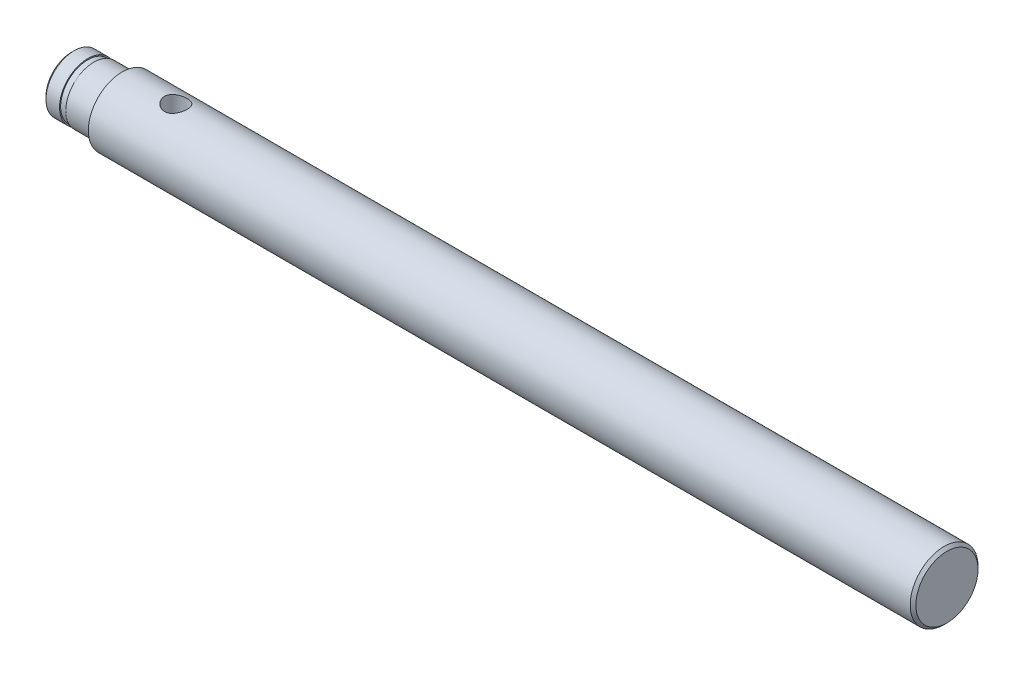
ISO-10303-21;
HEADER;
FILE_DESCRIPTION(('STEP AP214'),'2;1');
FILE_NAME('part.step','',(''),(''),'','','');
FILE_SCHEMA(('AUTOMOTIVE_DESIGN { 1 0 10303 214 1 1 1 1 }'));
ENDSEC;
DATA;
#1=APPLICATION_CONTEXT('core data for automotive mechanical design processes');
#2=APPLICATION_PROTOCOL_DEFINITION('international standard','automotive_design',2000,#1);
#3=PRODUCT_CONTEXT('',#1,'mechanical');
#4=PRODUCT('Part','Part','',(#3));
#5=PRODUCT_RELATED_PRODUCT_CATEGORY('part','',(#4));
#6=PRODUCT_DEFINITION_FORMATION('','',#4);
#7=PRODUCT_DEFINITION_CONTEXT('part definition',#1,'design');
#8=PRODUCT_DEFINITION('design','',#6,#7);
#9=PRODUCT_DEFINITION_SHAPE('','',#8);
#10=(LENGTH_UNIT() NAMED_UNIT(*) SI_UNIT(.MILLI.,.METRE.));
#11=(NAMED_UNIT(*) PLANE_ANGLE_UNIT() SI_UNIT($,.RADIAN.));
#12=(NAMED_UNIT(*) SI_UNIT($,.STERADIAN.) SOLID_ANGLE_UNIT());
#13=UNCERTAINTY_MEASURE_WITH_UNIT(LENGTH_MEASURE(1.E-05),#10,'distance_accuracy_value','');
#14=(GEOMETRIC_REPRESENTATION_CONTEXT(3) GLOBAL_UNCERTAINTY_ASSIGNED_CONTEXT((#13)) GLOBAL_UNIT_ASSIGNED_CONTEXT((#10,
#11,#12)) REPRESENTATION_CONTEXT('',''));
#15=CARTESIAN_POINT('',(0.,0.,0.));
#16=DIRECTION('',(0.,0.,1.));
#17=DIRECTION('',(1.,0.,0.));
#18=AXIS2_PLACEMENT_3D('',#15,#16,#17);
#19=CARTESIAN_POINT('',(155.,0.,0.));
#20=DIRECTION('',(-1.,0.,0.));
#21=DIRECTION('',(0.,0.,1.));
#22=AXIS2_PLACEMENT_3D('',#19,#20,#21);
#23=CYLINDRICAL_SURFACE('',#22,6.);
#24=CARTESIAN_POINT('',(154.5,0.,0.));
#25=DIRECTION('',(1.,0.,0.));
#26=DIRECTION('',(0.,0.,-1.));
#27=AXIS2_PLACEMENT_3D('',#24,#25,#26);
#28=CIRCLE('',#27,6.);
#29=CARTESIAN_POINT('',(154.5,0.,-6.));
#30=VERTEX_POINT('',#29);
#31=EDGE_CURVE('E50',#30,#30,#28,.F.);
#32=ORIENTED_EDGE('',*,*,#31,.T.);
#33=EDGE_LOOP('',(#32));
#34=FACE_BOUND('',#33,.T.);
#35=CARTESIAN_POINT('',(18.5,-5.65685424949238,2.));
#36=CARTESIAN_POINT('',(18.6089363496721,-5.65685389060868,2.00000051589543));
#37=CARTESIAN_POINT('',(18.7178695996472,-5.66003538581715,1.99106956737104));
#38=CARTESIAN_POINT('',(18.9325088419885,-5.6723514816251,1.95570226337762));
#39=CARTESIAN_POINT('',(19.0382142997449,-5.68148706284378,1.92926302433679));
#40=CARTESIAN_POINT('',(19.2432537859946,-5.70456407377583,1.85991097136981));
#41=CARTESIAN_POINT('',(19.3425998588854,-5.71849607942644,1.81703044280649));
#42=CARTESIAN_POINT('',(19.5327200970959,-5.74958244020649,1.71612325688276));
#43=CARTESIAN_POINT('',(19.6234923651073,-5.76673750607225,1.65809325772037));
#44=CARTESIAN_POINT('',(19.7974399246766,-5.80308978814946,1.52610229288576));
#45=CARTESIAN_POINT('',(19.8802308573435,-5.82233789689288,1.45164868275584));
#46=CARTESIAN_POINT('',(20.0324136024493,-5.86027729602006,1.28997533442879));
#47=CARTESIAN_POINT('',(20.1018032631647,-5.87896849657923,1.20275355010475));
#48=CARTESIAN_POINT('',(20.2269577946592,-5.91427733843598,1.01520901593002));
#49=CARTESIAN_POINT('',(20.2823199412359,-5.93082815403211,0.914603822449052));
#50=CARTESIAN_POINT('',(20.375183170255,-5.95939173541966,0.70486244597495));
#51=CARTESIAN_POINT('',(20.4126890663538,-5.97140572406004,0.595728571374426));
#52=CARTESIAN_POINT('',(20.4674717092648,-5.98918150863813,0.376057634866991));
#53=CARTESIAN_POINT('',(20.485406892514,-5.99514629555118,0.265701509705939));
#54=CARTESIAN_POINT('',(20.5026325867213,-6.00087216436496,0.0433957496481814));
#55=CARTESIAN_POINT('',(20.5019279033048,-6.00063484525791,-0.0685534670877907));
#56=CARTESIAN_POINT('',(20.4823114908679,-5.99412079237463,-0.286207030387627));
#57=CARTESIAN_POINT('',(20.464114943051,-5.98808129510235,-0.391984097183311));
#58=CARTESIAN_POINT('',(20.4112140380391,-5.97093934679463,-0.598886877644341));
#59=CARTESIAN_POINT('',(20.3765085620403,-5.95983655262364,-0.70001227555843));
#60=CARTESIAN_POINT('',(20.2911573653879,-5.93351340586449,-0.896304949683944));
#61=CARTESIAN_POINT('',(20.240308122907,-5.91824085048031,-0.991376441937688));
#62=CARTESIAN_POINT('',(20.1242805891027,-5.88516786077838,-1.17184865105464));
#63=CARTESIAN_POINT('',(20.0590983133447,-5.86736672402934,-1.25724666877068));
#64=CARTESIAN_POINT('',(19.9126512130806,-5.83012383699793,-1.42020173310261));
#65=CARTESIAN_POINT('',(19.830773684317,-5.81064430337755,-1.49720031413054));
#66=CARTESIAN_POINT('',(19.6551025485468,-5.77294670497801,-1.63655451919635));
#67=CARTESIAN_POINT('',(19.5613071085439,-5.75472883491231,-1.69890788656308));
#68=CARTESIAN_POINT('',(19.3626927487931,-5.72141050242225,-1.80797491007148));
#69=CARTESIAN_POINT('',(19.2577357373645,-5.70635818569496,-1.85445292724268));
#70=CARTESIAN_POINT('',(19.0408572115712,-5.6816330164877,-1.92888638653867));
#71=CARTESIAN_POINT('',(18.9289386375875,-5.67195790974185,-1.95684959149499));
#72=CARTESIAN_POINT('',(18.7067232891768,-5.6595927263117,-1.99232256419504));
#73=CARTESIAN_POINT('',(18.5965811505027,-5.65660720637512,-2.00069819101526));
#74=CARTESIAN_POINT('',(18.3764477017718,-5.65713344118369,-1.99921087781944));
#75=CARTESIAN_POINT('',(18.266456367952,-5.66064401583629,-1.98935125045352));
#76=CARTESIAN_POINT('',(18.0536860685762,-5.67347236180599,-1.95245130310462));
#77=CARTESIAN_POINT('',(17.9507891396983,-5.68258650881681,-1.92601278796137));
#78=CARTESIAN_POINT('',(17.7509127875216,-5.70537107342046,-1.85742772512093));
#79=CARTESIAN_POINT('',(17.6539344168184,-5.71904229869679,-1.81527839272684));
#80=CARTESIAN_POINT('',(17.465239158306,-5.74993755191574,-1.71494868147787));
#81=CARTESIAN_POINT('',(17.3737867147164,-5.76726051331257,-1.656302236717));
#82=CARTESIAN_POINT('',(17.2017078952326,-5.8033153746193,-1.52517126111512));
#83=CARTESIAN_POINT('',(17.1210847226776,-5.82204768887589,-1.45268265099757));
#84=CARTESIAN_POINT('',(16.9689440318187,-5.85990077275698,-1.29178341180065));
#85=CARTESIAN_POINT('',(16.8980512199623,-5.87899687155793,-1.20277454109331));
#86=CARTESIAN_POINT('',(16.7721677153039,-5.91453703226218,-1.01365458280052));
#87=CARTESIAN_POINT('',(16.7171764576752,-5.93098118835389,-0.913543889729108));
#88=CARTESIAN_POINT('',(16.6251597902766,-5.95928811621206,-0.705559724864595));
#89=CARTESIAN_POINT('',(16.5880174457039,-5.97118060009062,-0.597742246642396));
#90=CARTESIAN_POINT('',(16.5325445158798,-5.98917221675549,-0.376916931692034));
#91=CARTESIAN_POINT('',(16.514207140239,-5.99527344068038,-0.263910983907781));
#92=CARTESIAN_POINT('',(16.4974758447887,-6.00083726472513,-0.0416306717200835));
#93=CARTESIAN_POINT('',(16.4981850921352,-6.00059840178878,0.0675694478400356));
#94=CARTESIAN_POINT('',(16.5173146162928,-5.99424393038796,0.284222290000346));
#95=CARTESIAN_POINT('',(16.5357334563055,-5.98812879867152,0.391675153638112));
#96=CARTESIAN_POINT('',(16.5891644691519,-5.97081829908825,0.600084238864116));
#97=CARTESIAN_POINT('',(16.6239084307059,-5.95970516722297,0.701116541825576));
#98=CARTESIAN_POINT('',(16.7087550621943,-5.9335432140899,0.895956701879589));
#99=CARTESIAN_POINT('',(16.758860510394,-5.91849368096033,0.989763248284862));
#100=CARTESIAN_POINT('',(16.875139024204,-5.88531737655762,1.17126803261757));
#101=CARTESIAN_POINT('',(16.9418373707633,-5.86709744983853,1.25861250311521));
#102=CARTESIAN_POINT('',(17.0885147823124,-5.82985977583759,1.42116205254485));
#103=CARTESIAN_POINT('',(17.1684980845255,-5.81084177546194,1.49636324324918));
#104=CARTESIAN_POINT('',(17.3432187111739,-5.77326559651197,1.63548361766623));
#105=CARTESIAN_POINT('',(17.4384110219533,-5.75475455977261,1.6988459319958));
#106=CARTESIAN_POINT('',(17.6386688538056,-5.72120386646031,1.80862868660223));
#107=CARTESIAN_POINT('',(17.7437317860593,-5.70616330322499,1.85505355363895));
#108=CARTESIAN_POINT('',(17.9559236480313,-5.68202668413029,1.92768765640833));
#109=CARTESIAN_POINT('',(18.0627445270507,-5.67269265714364,1.95471581829904));
#110=CARTESIAN_POINT('',(18.2797121009334,-5.66010767079037,1.99086864029853));
#111=CARTESIAN_POINT('',(18.3898576348214,-5.65685461234922,1.99999947839318));
#112=CARTESIAN_POINT('',(18.5,-5.65685424949238,2.));
#113=B_SPLINE_CURVE_WITH_KNOTS('',3,(#35,#36,#37,#38,#39,#40,#41,#42,#43,#44,#45,#46,#47,#48,
#49,#50,#51,#52,#53,#54,#55,#56,#57,#58,#59,#60,#61,#62,#63,#64,#65,#66,#67,#68,#69,#70,#71,#72,
#73,#74,#75,#76,#77,#78,#79,#80,#81,#82,#83,#84,#85,#86,#87,#88,#89,#90,#91,#92,#93,#94,#95,#96,
#97,#98,#99,#100,#101,#102,#103,#104,#105,#106,#107,#108,#109,#110,#111,#112),.UNSPECIFIED.,.T.,
.F.,(4,2,2,2,2,2,2,2,2,2,2,2,2,2,2,2,2,2,2,2,2,2,2,2,2,2,2,2,2,2,2,2,2,2,2,2,2,2,4),(0.,
0.326401169598711,0.652856110030327,0.978673255001653,1.30456233237088,1.64202674855136,
1.97954530343975,2.32587012287314,2.67210152773578,3.00628637529868,3.34038506604654,
3.66138009651138,3.98239688378473,4.3076330972067,4.63295983748044,4.97360348727835,
5.31429959224212,5.65985279686111,6.00526102713231,6.33508582728879,6.66485071674467,
6.98328791537552,7.30178158293891,7.63037715471429,7.95906971324254,8.30357616342185,
8.64807037515064,8.99027582381702,9.33235766008312,9.6583616935527,9.98433928019562,
10.3051391208086,10.6259970152648,10.9587103904127,11.2915300886526,11.6373780547229,
11.9831355653373,12.3132642432538,12.6432789438093),.UNSPECIFIED.);
#114=CARTESIAN_POINT('',(18.5,-5.65685424949238,2.));
#115=VERTEX_POINT('',#114);
#116=EDGE_CURVE('E57',#115,#115,#113,.T.);
#117=ORIENTED_EDGE('',*,*,#116,.T.);
#118=EDGE_LOOP('',(#117));
#119=FACE_BOUND('',#118,.T.);
#120=CARTESIAN_POINT('',(18.5,5.65685424949238,2.));
#121=CARTESIAN_POINT('',(18.3910636503279,5.65685389060868,2.00000051589543));
#122=CARTESIAN_POINT('',(18.2821304003528,5.66003538581715,1.99106956737104));
#123=CARTESIAN_POINT('',(18.0674911580115,5.6723514816251,1.95570226337762));
#124=CARTESIAN_POINT('',(17.9617857002551,5.68148706284378,1.92926302433679));
#125=CARTESIAN_POINT('',(17.7567462140054,5.70456407377583,1.85991097136981));
#126=CARTESIAN_POINT('',(17.6574001411146,5.71849607942644,1.81703044280649));
#127=CARTESIAN_POINT('',(17.4672799029041,5.74958244020649,1.71612325688276));
#128=CARTESIAN_POINT('',(17.3765076348927,5.76673750607225,1.65809325772037));
#129=CARTESIAN_POINT('',(17.2025600753234,5.80308978814946,1.52610229288576));
#130=CARTESIAN_POINT('',(17.1197691426565,5.82233789689288,1.45164868275584));
#131=CARTESIAN_POINT('',(16.9675863975507,5.86027729602006,1.28997533442879));
#132=CARTESIAN_POINT('',(16.8981967368353,5.87896849657923,1.20275355010475));
#133=CARTESIAN_POINT('',(16.7730422053408,5.91427733843598,1.01520901593002));
#134=CARTESIAN_POINT('',(16.7176800587641,5.93082815403211,0.914603822449052));
#135=CARTESIAN_POINT('',(16.624816829745,5.95939173541966,0.70486244597495));
#136=CARTESIAN_POINT('',(16.5873109336462,5.97140572406004,0.595728571374426));
#137=CARTESIAN_POINT('',(16.5325282907352,5.98918150863813,0.376057634866991));
#138=CARTESIAN_POINT('',(16.514593107486,5.99514629555118,0.265701509705939));
#139=CARTESIAN_POINT('',(16.4973674132787,6.00087216436496,0.0433957496481814));
#140=CARTESIAN_POINT('',(16.4980720966952,6.00063484525791,-0.0685534670877907));
#141=CARTESIAN_POINT('',(16.5176885091321,5.99412079237463,-0.286207030387627));
#142=CARTESIAN_POINT('',(16.535885056949,5.98808129510235,-0.391984097183311));
#143=CARTESIAN_POINT('',(16.5887859619609,5.97093934679463,-0.598886877644341));
#144=CARTESIAN_POINT('',(16.6234914379596,5.95983655262364,-0.70001227555843));
#145=CARTESIAN_POINT('',(16.7088426346121,5.93351340586449,-0.896304949683944));
#146=CARTESIAN_POINT('',(16.759691877093,5.91824085048031,-0.991376441937689));
#147=CARTESIAN_POINT('',(16.8757194108973,5.88516786077838,-1.17184865105464));
#148=CARTESIAN_POINT('',(16.9409016866553,5.86736672402934,-1.25724666877068));
#149=CARTESIAN_POINT('',(17.0873487869194,5.83012383699793,-1.42020173310261));
#150=CARTESIAN_POINT('',(17.169226315683,5.81064430337755,-1.49720031413054));
#151=CARTESIAN_POINT('',(17.3448974514532,5.77294670497801,-1.63655451919635));
#152=CARTESIAN_POINT('',(17.4386928914561,5.75472883491231,-1.69890788656308));
#153=CARTESIAN_POINT('',(17.6373072512069,5.72141050242225,-1.80797491007148));
#154=CARTESIAN_POINT('',(17.7422642626355,5.70635818569496,-1.85445292724268));
#155=CARTESIAN_POINT('',(17.9591427884288,5.6816330164877,-1.92888638653867));
#156=CARTESIAN_POINT('',(18.0710613624125,5.67195790974185,-1.95684959149499));
#157=CARTESIAN_POINT('',(18.2932767108231,5.6595927263117,-1.99232256419504));
#158=CARTESIAN_POINT('',(18.4034188494973,5.65660720637512,-2.00069819101526));
#159=CARTESIAN_POINT('',(18.6235522982282,5.65713344118369,-1.99921087781944));
#160=CARTESIAN_POINT('',(18.733543632048,5.66064401583629,-1.98935125045352));
#161=CARTESIAN_POINT('',(18.9463139314238,5.67347236180599,-1.95245130310462));
#162=CARTESIAN_POINT('',(19.0492108603017,5.68258650881681,-1.92601278796137));
#163=CARTESIAN_POINT('',(19.2490872124784,5.70537107342046,-1.85742772512093));
#164=CARTESIAN_POINT('',(19.3460655831816,5.71904229869679,-1.81527839272684));
#165=CARTESIAN_POINT('',(19.534760841694,5.74993755191574,-1.71494868147787));
#166=CARTESIAN_POINT('',(19.6262132852836,5.76726051331257,-1.656302236717));
#167=CARTESIAN_POINT('',(19.7982921047674,5.8033153746193,-1.52517126111512));
#168=CARTESIAN_POINT('',(19.8789152773224,5.82204768887589,-1.45268265099757));
#169=CARTESIAN_POINT('',(20.0310559681813,5.85990077275698,-1.29178341180065));
#170=CARTESIAN_POINT('',(20.1019487800377,5.87899687155793,-1.20277454109331));
#171=CARTESIAN_POINT('',(20.2278322846961,5.91453703226218,-1.01365458280052));
#172=CARTESIAN_POINT('',(20.2828235423248,5.93098118835389,-0.913543889729108));
#173=CARTESIAN_POINT('',(20.3748402097234,5.95928811621206,-0.705559724864595));
#174=CARTESIAN_POINT('',(20.4119825542961,5.97118060009062,-0.597742246642396));
#175=CARTESIAN_POINT('',(20.4674554841202,5.98917221675549,-0.376916931692034));
#176=CARTESIAN_POINT('',(20.485792859761,5.99527344068038,-0.26391098390778));
#177=CARTESIAN_POINT('',(20.5025241552113,6.00083726472513,-0.0416306717200833));
#178=CARTESIAN_POINT('',(20.5018149078648,6.00059840178878,0.067569447840036));
#179=CARTESIAN_POINT('',(20.4826853837072,5.99424393038796,0.284222290000347));
#180=CARTESIAN_POINT('',(20.4642665436945,5.98812879867152,0.391675153638112));
#181=CARTESIAN_POINT('',(20.4108355308481,5.97081829908825,0.600084238864116));
#182=CARTESIAN_POINT('',(20.3760915692941,5.95970516722297,0.701116541825577));
#183=CARTESIAN_POINT('',(20.2912449378057,5.9335432140899,0.89595670187959));
#184=CARTESIAN_POINT('',(20.241139489606,5.91849368096033,0.989763248284862));
#185=CARTESIAN_POINT('',(20.124860975796,5.88531737655762,1.17126803261757));
#186=CARTESIAN_POINT('',(20.0581626292367,5.86709744983853,1.25861250311521));
#187=CARTESIAN_POINT('',(19.9114852176876,5.82985977583759,1.42116205254485));
#188=CARTESIAN_POINT('',(19.8315019154745,5.81084177546194,1.49636324324918));
#189=CARTESIAN_POINT('',(19.6567812888261,5.77326559651197,1.63548361766623));
#190=CARTESIAN_POINT('',(19.5615889780467,5.75475455977261,1.6988459319958));
#191=CARTESIAN_POINT('',(19.3613311461944,5.72120386646031,1.80862868660223));
#192=CARTESIAN_POINT('',(19.2562682139407,5.70616330322499,1.85505355363895));
#193=CARTESIAN_POINT('',(19.0440763519687,5.68202668413029,1.92768765640833));
#194=CARTESIAN_POINT('',(18.9372554729493,5.67269265714364,1.95471581829904));
#195=CARTESIAN_POINT('',(18.7202878990666,5.66010767079037,1.99086864029853));
#196=CARTESIAN_POINT('',(18.6101423651786,5.65685461234922,1.99999947839318));
#197=CARTESIAN_POINT('',(18.5,5.65685424949238,2.));
#198=B_SPLINE_CURVE_WITH_KNOTS('',3,(#120,#121,#122,#123,#124,#125,#126,#127,#128,#129,#130,
#131,#132,#133,#134,#135,#136,#137,#138,#139,#140,#141,#142,#143,#144,#145,#146,#147,#148,#149,
#150,#151,#152,#153,#154,#155,#156,#157,#158,#159,#160,#161,#162,#163,#164,#165,#166,#167,#168,
#169,#170,#171,#172,#173,#174,#175,#176,#177,#178,#179,#180,#181,#182,#183,#184,#185,#186,#187,
#188,#189,#190,#191,#192,#193,#194,#195,#196,#197),.UNSPECIFIED.,.T.,.F.,(4,2,2,2,2,2,2,2,2,2,2,
2,2,2,2,2,2,2,2,2,2,2,2,2,2,2,2,2,2,2,2,2,2,2,2,2,2,2,4),(0.,0.326401169598711,
0.652856110030327,0.978673255001653,1.30456233237088,1.64202674855136,1.97954530343975,
2.32587012287314,2.67210152773578,3.00628637529868,3.34038506604654,3.66138009651138,
3.98239688378473,4.3076330972067,4.63295983748043,4.97360348727835,5.31429959224211,
5.65985279686111,6.00526102713231,6.33508582728879,6.66485071674467,6.98328791537552,
7.30178158293891,7.63037715471429,7.95906971324254,8.30357616342185,8.64807037515064,
8.99027582381702,9.33235766008312,9.6583616935527,9.98433928019561,10.3051391208086,
10.6259970152648,10.9587103904127,11.2915300886526,11.6373780547229,11.9831355653373,
12.3132642432538,12.6432789438093),.UNSPECIFIED.);
#199=CARTESIAN_POINT('',(18.5,5.65685424949238,2.));
#200=VERTEX_POINT('',#199);
#201=EDGE_CURVE('E66',#200,#200,#198,.T.);
#202=ORIENTED_EDGE('',*,*,#201,.T.);
#203=EDGE_LOOP('',(#202));
#204=FACE_BOUND('',#203,.T.);
#205=CARTESIAN_POINT('',(9.00000000000001,0.,0.));
#206=DIRECTION('',(1.,0.,0.));
#207=DIRECTION('',(0.,0.,-1.));
#208=AXIS2_PLACEMENT_3D('',#205,#206,#207);
#209=CIRCLE('',#208,6.);
#210=CARTESIAN_POINT('',(9.00000000000001,0.,-6.));
#211=VERTEX_POINT('',#210);
#212=EDGE_CURVE('E56',#211,#211,#209,.T.);
#213=ORIENTED_EDGE('',*,*,#212,.T.);
#214=EDGE_LOOP('',(#213));
#215=FACE_BOUND('',#214,.T.);
#216=ADVANCED_FACE('F30',(#34,#119,#204,#215),#23,.T.);
#217=CARTESIAN_POINT('',(155.,0.,0.));
#218=DIRECTION('',(1.,0.,0.));
#219=DIRECTION('',(0.,0.,-1.));
#220=AXIS2_PLACEMENT_3D('',#217,#218,#219);
#221=PLANE('',#220);
#222=CARTESIAN_POINT('',(155.,0.,0.));
#223=DIRECTION('',(1.,0.,0.));
#224=DIRECTION('',(0.,0.,-1.));
#225=AXIS2_PLACEMENT_3D('',#222,#223,#224);
#226=CIRCLE('',#225,5.50000000000003);
#227=CARTESIAN_POINT('',(155.,0.,-5.50000000000003));
#228=VERTEX_POINT('',#227);
#229=EDGE_CURVE('E53',#228,#228,#226,.T.);
#230=ORIENTED_EDGE('',*,*,#229,.T.);
#231=EDGE_LOOP('',(#230));
#232=FACE_BOUND('',#231,.T.);
#233=ADVANCED_FACE('F103',(#232),#221,.T.);
#234=CARTESIAN_POINT('',(155.,0.,0.));
#235=DIRECTION('',(1.,0.,0.));
#236=DIRECTION('',(0.,0.,-1.));
#237=AXIS2_PLACEMENT_3D('',#234,#235,#236);
#238=CYLINDRICAL_SURFACE('',#237,5.);
#239=CARTESIAN_POINT('',(0.500000000000056,0.,0.));
#240=DIRECTION('',(1.,0.,0.));
#241=DIRECTION('',(0.,0.,-1.));
#242=AXIS2_PLACEMENT_3D('',#239,#240,#241);
#243=CIRCLE('',#242,5.);
#244=CARTESIAN_POINT('',(0.500000000000056,0.,-5.));
#245=VERTEX_POINT('',#244);
#246=EDGE_CURVE('E45',#245,#245,#243,.T.);
#247=ORIENTED_EDGE('',*,*,#246,.T.);
#248=EDGE_LOOP('',(#247));
#249=FACE_BOUND('',#248,.T.);
#250=CARTESIAN_POINT('',(2.89999999999999,0.,0.));
#251=DIRECTION('',(1.,0.,0.));
#252=DIRECTION('',(0.,0.,-1.));
#253=AXIS2_PLACEMENT_3D('',#250,#251,#252);
#254=CIRCLE('',#253,5.);
#255=CARTESIAN_POINT('',(2.89999999999999,0.,-5.));
#256=VERTEX_POINT('',#255);
#257=EDGE_CURVE('E65',#256,#256,#254,.T.);
#258=ORIENTED_EDGE('',*,*,#257,.F.);
#259=EDGE_LOOP('',(#258));
#260=FACE_BOUND('',#259,.T.);
#261=ADVANCED_FACE('F100',(#249,#260),#238,.T.);
#262=CARTESIAN_POINT('',(9.,6.,0.));
#263=DIRECTION('',(1.,0.,0.));
#264=DIRECTION('',(0.,0.,-1.));
#265=AXIS2_PLACEMENT_3D('',#262,#263,#264);
#266=PLANE('',#265);
#267=CARTESIAN_POINT('',(9.,0.,0.));
#268=DIRECTION('',(1.,0.,0.));
#269=DIRECTION('',(0.,0.,-1.));
#270=AXIS2_PLACEMENT_3D('',#267,#268,#269);
#271=CIRCLE('',#270,5.3);
#272=CARTESIAN_POINT('',(9.,0.,-5.3));
#273=VERTEX_POINT('',#272);
#274=EDGE_CURVE('E37',#273,#273,#271,.T.);
#275=ORIENTED_EDGE('',*,*,#274,.T.);
#276=EDGE_LOOP('',(#275));
#277=FACE_BOUND('',#276,.T.);
#278=ORIENTED_EDGE('',*,*,#212,.F.);
#279=EDGE_LOOP('',(#278));
#280=FACE_BOUND('',#279,.T.);
#281=ADVANCED_FACE('F97',(#277,#280),#266,.F.);
#282=CARTESIAN_POINT('',(155.,0.,0.));
#283=DIRECTION('',(1.,0.,0.));
#284=DIRECTION('',(0.,0.,-1.));
#285=AXIS2_PLACEMENT_3D('',#282,#283,#284);
#286=CYLINDRICAL_SURFACE('',#285,5.);
#287=CARTESIAN_POINT('',(8.70000000000001,0.,0.));
#288=DIRECTION('',(1.,0.,0.));
#289=DIRECTION('',(0.,0.,-1.));
#290=AXIS2_PLACEMENT_3D('',#287,#288,#289);
#291=CIRCLE('',#290,5.);
#292=CARTESIAN_POINT('',(8.70000000000001,0.,-5.));
#293=VERTEX_POINT('',#292);
#294=EDGE_CURVE('E10',#293,#293,#291,.F.);
#295=ORIENTED_EDGE('',*,*,#294,.T.);
#296=EDGE_LOOP('',(#295));
#297=FACE_BOUND('',#296,.T.);
#298=CARTESIAN_POINT('',(4.,0.,0.));
#299=DIRECTION('',(1.,0.,0.));
#300=DIRECTION('',(0.,0.,-1.));
#301=AXIS2_PLACEMENT_3D('',#298,#299,#300);
#302=CIRCLE('',#301,5.);
#303=CARTESIAN_POINT('',(4.,0.,-5.));
#304=VERTEX_POINT('',#303);
#305=EDGE_CURVE('E125',#304,#304,#302,.T.);
#306=ORIENTED_EDGE('',*,*,#305,.T.);
#307=EDGE_LOOP('',(#306));
#308=FACE_BOUND('',#307,.T.);
#309=ADVANCED_FACE('F93',(#297,#308),#286,.T.);
#310=CARTESIAN_POINT('',(4.,5.,0.));
#311=DIRECTION('',(1.,0.,0.));
#312=DIRECTION('',(0.,0.,-1.));
#313=AXIS2_PLACEMENT_3D('',#310,#311,#312);
#314=PLANE('',#313);
#315=ORIENTED_EDGE('',*,*,#305,.F.);
#316=EDGE_LOOP('',(#315));
#317=FACE_BOUND('',#316,.T.);
#318=CARTESIAN_POINT('',(4.,0.,0.));
#319=DIRECTION('',(1.,0.,0.));
#320=DIRECTION('',(0.,0.,-1.));
#321=AXIS2_PLACEMENT_3D('',#318,#319,#320);
#322=CIRCLE('',#321,4.8);
#323=CARTESIAN_POINT('',(4.,0.,-4.8));
#324=VERTEX_POINT('',#323);
#325=EDGE_CURVE('E127',#324,#324,#322,.T.);
#326=ORIENTED_EDGE('',*,*,#325,.T.);
#327=EDGE_LOOP('',(#326));
#328=FACE_BOUND('',#327,.T.);
#329=ADVANCED_FACE('F89',(#317,#328),#314,.F.);
#330=CARTESIAN_POINT('',(155.,0.,0.));
#331=DIRECTION('',(1.,0.,0.));
#332=DIRECTION('',(0.,0.,-1.));
#333=AXIS2_PLACEMENT_3D('',#330,#331,#332);
#334=CYLINDRICAL_SURFACE('',#333,4.8);
#335=ORIENTED_EDGE('',*,*,#325,.F.);
#336=EDGE_LOOP('',(#335));
#337=FACE_BOUND('',#336,.T.);
#338=CARTESIAN_POINT('',(2.89999999999999,0.,0.));
#339=DIRECTION('',(1.,0.,0.));
#340=DIRECTION('',(0.,0.,-1.));
#341=AXIS2_PLACEMENT_3D('',#338,#339,#340);
#342=CIRCLE('',#341,4.8);
#343=CARTESIAN_POINT('',(2.89999999999999,0.,-4.8));
#344=VERTEX_POINT('',#343);
#345=EDGE_CURVE('E132',#344,#344,#342,.T.);
#346=ORIENTED_EDGE('',*,*,#345,.T.);
#347=EDGE_LOOP('',(#346));
#348=FACE_BOUND('',#347,.T.);
#349=ADVANCED_FACE('F85',(#337,#348),#334,.T.);
#350=CARTESIAN_POINT('',(2.9,4.8,0.));
#351=DIRECTION('',(-1.,0.,0.));
#352=DIRECTION('',(0.,0.,1.));
#353=AXIS2_PLACEMENT_3D('',#350,#351,#352);
#354=PLANE('',#353);
#355=ORIENTED_EDGE('',*,*,#345,.F.);
#356=EDGE_LOOP('',(#355));
#357=FACE_BOUND('',#356,.T.);
#358=ORIENTED_EDGE('',*,*,#257,.T.);
#359=EDGE_LOOP('',(#358));
#360=FACE_BOUND('',#359,.T.);
#361=ADVANCED_FACE('F81',(#357,#360),#354,.F.);
#362=CARTESIAN_POINT('',(0.,0.,0.));
#363=DIRECTION('',(1.,0.,0.));
#364=DIRECTION('',(0.,0.,-1.));
#365=AXIS2_PLACEMENT_3D('',#362,#363,#364);
#366=PLANE('',#365);
#367=CARTESIAN_POINT('',(0.,0.,0.));
#368=DIRECTION('',(1.,0.,0.));
#369=DIRECTION('',(0.,0.,-1.));
#370=AXIS2_PLACEMENT_3D('',#367,#368,#369);
#371=CIRCLE('',#370,4.49999999999995);
#372=CARTESIAN_POINT('',(0.,0.,-4.49999999999995));
#373=VERTEX_POINT('',#372);
#374=EDGE_CURVE('E41',#373,#373,#371,.F.);
#375=ORIENTED_EDGE('',*,*,#374,.T.);
#376=EDGE_LOOP('',(#375));
#377=FACE_BOUND('',#376,.T.);
#378=ADVANCED_FACE('F79',(#377),#366,.F.);
#379=CARTESIAN_POINT('',(18.5,-10.,0.));
#380=DIRECTION('',(0.,1.,0.));
#381=DIRECTION('',(0.,0.,1.));
#382=AXIS2_PLACEMENT_3D('',#379,#380,#381);
#383=CYLINDRICAL_SURFACE('',#382,2.);
#384=ORIENTED_EDGE('',*,*,#201,.F.);
#385=EDGE_LOOP('',(#384));
#386=FACE_BOUND('',#385,.T.);
#387=ORIENTED_EDGE('',*,*,#116,.F.);
#388=EDGE_LOOP('',(#387));
#389=FACE_BOUND('',#388,.T.);
#390=ADVANCED_FACE('F74',(#386,#389),#383,.F.);
#391=CARTESIAN_POINT('',(155.,0.,0.));
#392=DIRECTION('',(-1.,0.,0.));
#393=DIRECTION('',(0.,0.,1.));
#394=AXIS2_PLACEMENT_3D('',#391,#392,#393);
#395=CONICAL_SURFACE('',#394,5.50000000000003,0.785398163397416);
#396=ORIENTED_EDGE('',*,*,#31,.F.);
#397=EDGE_LOOP('',(#396));
#398=FACE_BOUND('',#397,.T.);
#399=ORIENTED_EDGE('',*,*,#229,.F.);
#400=EDGE_LOOP('',(#399));
#401=FACE_BOUND('',#400,.T.);
#402=ADVANCED_FACE('F78',(#398,#401),#395,.T.);
#403=CARTESIAN_POINT('',(0.500000000000056,0.,0.));
#404=DIRECTION('',(1.,0.,0.));
#405=DIRECTION('',(0.,0.,-1.));
#406=AXIS2_PLACEMENT_3D('',#403,#404,#405);
#407=CONICAL_SURFACE('',#406,5.,0.785398163397444);
#408=ORIENTED_EDGE('',*,*,#374,.F.);
#409=EDGE_LOOP('',(#408));
#410=FACE_BOUND('',#409,.T.);
#411=ORIENTED_EDGE('',*,*,#246,.F.);
#412=EDGE_LOOP('',(#411));
#413=FACE_BOUND('',#412,.T.);
#414=ADVANCED_FACE('F149',(#410,#413),#407,.T.);
#415=CARTESIAN_POINT('',(8.70000000000001,0.,0.));
#416=DIRECTION('',(1.,0.,0.));
#417=DIRECTION('',(0.,0.,-1.));
#418=AXIS2_PLACEMENT_3D('',#415,#416,#417);
#419=TOROIDAL_SURFACE('',#418,5.3,0.3);
#420=ORIENTED_EDGE('',*,*,#294,.F.);
#421=EDGE_LOOP('',(#420));
#422=FACE_BOUND('',#421,.T.);
#423=ORIENTED_EDGE('',*,*,#274,.F.);
#424=EDGE_LOOP('',(#423));
#425=FACE_BOUND('',#424,.T.);
#426=ADVANCED_FACE('F32',(#422,#425),#419,.F.);
#427=CLOSED_SHELL('',(#216,#233,#261,#281,#309,#329,#349,#361,#378,#390,#402,#414,#426));
#428=MANIFOLD_SOLID_BREP('B2',#427);
#429=ADVANCED_BREP_SHAPE_REPRESENTATION('',(#18,#428),#14);
#430=SHAPE_DEFINITION_REPRESENTATION(#9,#429);
ENDSEC;
END-ISO-10303-21;
